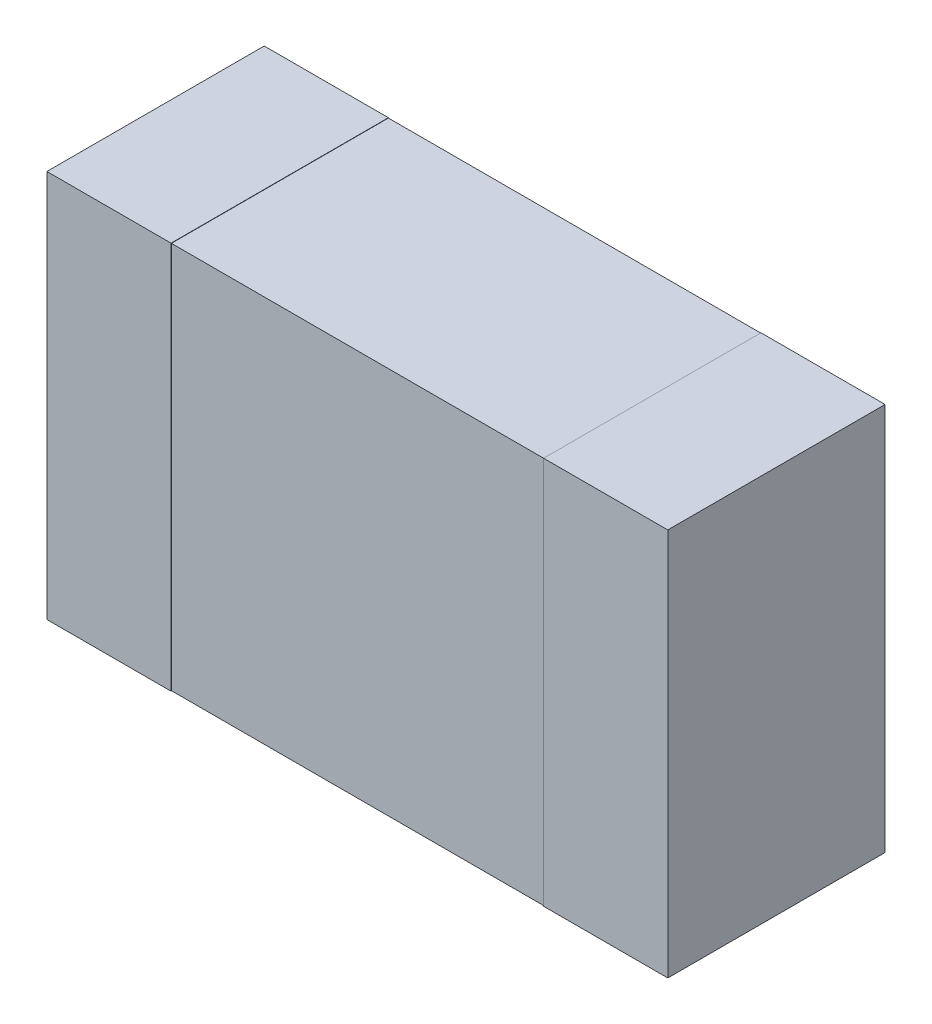
ISO-10303-21;
HEADER;
FILE_DESCRIPTION(('STEP AP214'),'2;1');
FILE_NAME('part.step','',(''),(''),'','','');
FILE_SCHEMA(('AUTOMOTIVE_DESIGN { 1 0 10303 214 1 1 1 1 }'));
ENDSEC;
DATA;
#1=APPLICATION_CONTEXT('core data for automotive mechanical design processes');
#2=APPLICATION_PROTOCOL_DEFINITION('international standard','automotive_design',2000,#1);
#3=PRODUCT_CONTEXT('',#1,'mechanical');
#4=PRODUCT('Part','Part','',(#3));
#5=PRODUCT_RELATED_PRODUCT_CATEGORY('part','',(#4));
#6=PRODUCT_DEFINITION_FORMATION('','',#4);
#7=PRODUCT_DEFINITION_CONTEXT('part definition',#1,'design');
#8=PRODUCT_DEFINITION('design','',#6,#7);
#9=PRODUCT_DEFINITION_SHAPE('','',#8);
#10=(LENGTH_UNIT() NAMED_UNIT(*) SI_UNIT(.MILLI.,.METRE.));
#11=(NAMED_UNIT(*) PLANE_ANGLE_UNIT() SI_UNIT($,.RADIAN.));
#12=(NAMED_UNIT(*) SI_UNIT($,.STERADIAN.) SOLID_ANGLE_UNIT());
#13=UNCERTAINTY_MEASURE_WITH_UNIT(LENGTH_MEASURE(1.E-05),#10,'distance_accuracy_value','');
#14=(GEOMETRIC_REPRESENTATION_CONTEXT(3) GLOBAL_UNCERTAINTY_ASSIGNED_CONTEXT((#13)) GLOBAL_UNIT_ASSIGNED_CONTEXT((#10,
#11,#12)) REPRESENTATION_CONTEXT('',''));
#15=CARTESIAN_POINT('',(0.,0.,0.));
#16=DIRECTION('',(0.,0.,1.));
#17=DIRECTION('',(1.,0.,0.));
#18=AXIS2_PLACEMENT_3D('',#15,#16,#17);
#19=CARTESIAN_POINT('',(0.6,-0.625,0.699));
#20=DIRECTION('',(0.,0.,-1.));
#21=DIRECTION('',(-1.,0.,0.));
#22=AXIS2_PLACEMENT_3D('',#19,#20,#21);
#23=PLANE('',#22);
#24=DIRECTION('',(0.,1.,0.));
#25=VECTOR('',#24,1.);
#26=CARTESIAN_POINT('',(0.6,-0.625,0.699));
#27=LINE('',#26,#25);
#28=CARTESIAN_POINT('',(0.6,-0.624,0.699));
#29=VERTEX_POINT('',#28);
#30=CARTESIAN_POINT('',(0.6,0.624,0.699));
#31=VERTEX_POINT('',#30);
#32=EDGE_CURVE('E45',#29,#31,#27,.T.);
#33=ORIENTED_EDGE('',*,*,#32,.T.);
#34=DIRECTION('',(-1.,0.,0.));
#35=VECTOR('',#34,1.);
#36=CARTESIAN_POINT('',(0.6,0.624,0.699));
#37=LINE('',#36,#35);
#38=CARTESIAN_POINT('',(-0.6,0.624,0.699));
#39=VERTEX_POINT('',#38);
#40=EDGE_CURVE('E184',#31,#39,#37,.T.);
#41=ORIENTED_EDGE('',*,*,#40,.T.);
#42=DIRECTION('',(0.,1.,0.));
#43=VECTOR('',#42,1.);
#44=CARTESIAN_POINT('',(-0.6,-0.625,0.699));
#45=LINE('',#44,#43);
#46=CARTESIAN_POINT('',(-0.6,-0.624,0.699));
#47=VERTEX_POINT('',#46);
#48=EDGE_CURVE('E22',#47,#39,#45,.T.);
#49=ORIENTED_EDGE('',*,*,#48,.F.);
#50=DIRECTION('',(-1.,0.,0.));
#51=VECTOR('',#50,1.);
#52=CARTESIAN_POINT('',(0.6,-0.624,0.699));
#53=LINE('',#52,#51);
#54=EDGE_CURVE('E11',#29,#47,#53,.T.);
#55=ORIENTED_EDGE('',*,*,#54,.F.);
#56=EDGE_LOOP('',(#33,#41,#49,#55));
#57=FACE_BOUND('',#56,.T.);
#58=ADVANCED_FACE('F18',(#57),#23,.F.);
#59=CARTESIAN_POINT('',(0.6,-0.624,0.7));
#60=DIRECTION('',(0.,1.,0.));
#61=DIRECTION('',(1.,0.,0.));
#62=AXIS2_PLACEMENT_3D('',#59,#60,#61);
#63=PLANE('',#62);
#64=DIRECTION('',(0.,0.,-1.));
#65=VECTOR('',#64,1.);
#66=CARTESIAN_POINT('',(0.6,-0.624,0.7));
#67=LINE('',#66,#65);
#68=CARTESIAN_POINT('',(0.6,-0.624,0.));
#69=VERTEX_POINT('',#68);
#70=EDGE_CURVE('E28',#29,#69,#67,.T.);
#71=ORIENTED_EDGE('',*,*,#70,.F.);
#72=ORIENTED_EDGE('',*,*,#54,.T.);
#73=DIRECTION('',(0.,0.,-1.));
#74=VECTOR('',#73,1.);
#75=CARTESIAN_POINT('',(-0.6,-0.624,0.7));
#76=LINE('',#75,#74);
#77=CARTESIAN_POINT('',(-0.6,-0.624,0.));
#78=VERTEX_POINT('',#77);
#79=EDGE_CURVE('E230',#47,#78,#76,.T.);
#80=ORIENTED_EDGE('',*,*,#79,.T.);
#81=DIRECTION('',(1.,0.,0.));
#82=VECTOR('',#81,1.);
#83=CARTESIAN_POINT('',(0.6,-0.624,0.));
#84=LINE('',#83,#82);
#85=EDGE_CURVE('E147',#78,#69,#84,.T.);
#86=ORIENTED_EDGE('',*,*,#85,.T.);
#87=EDGE_LOOP('',(#71,#72,#80,#86));
#88=FACE_BOUND('',#87,.T.);
#89=ADVANCED_FACE('F270',(#88),#63,.F.);
#90=CARTESIAN_POINT('',(0.6,0.625,0.7));
#91=DIRECTION('',(1.,0.,0.));
#92=DIRECTION('',(0.,1.,0.));
#93=AXIS2_PLACEMENT_3D('',#90,#91,#92);
#94=PLANE('',#93);
#95=DIRECTION('',(0.,-1.,0.));
#96=VECTOR('',#95,1.);
#97=CARTESIAN_POINT('',(0.6,0.625,0.));
#98=LINE('',#97,#96);
#99=CARTESIAN_POINT('',(0.6,0.625,0.));
#100=VERTEX_POINT('',#99);
#101=CARTESIAN_POINT('',(0.6,0.624,0.));
#102=VERTEX_POINT('',#101);
#103=EDGE_CURVE('E219',#100,#102,#98,.T.);
#104=ORIENTED_EDGE('',*,*,#103,.T.);
#105=DIRECTION('',(0.,0.,-1.));
#106=VECTOR('',#105,1.);
#107=CARTESIAN_POINT('',(0.6,0.624,0.7));
#108=LINE('',#107,#106);
#109=EDGE_CURVE('E195',#31,#102,#108,.T.);
#110=ORIENTED_EDGE('',*,*,#109,.F.);
#111=ORIENTED_EDGE('',*,*,#32,.F.);
#112=ORIENTED_EDGE('',*,*,#70,.T.);
#113=DIRECTION('',(0.,-1.,0.));
#114=VECTOR('',#113,1.);
#115=CARTESIAN_POINT('',(0.6,-0.624,0.));
#116=LINE('',#115,#114);
#117=CARTESIAN_POINT('',(0.6,-0.625,0.));
#118=VERTEX_POINT('',#117);
#119=EDGE_CURVE('E233',#69,#118,#116,.T.);
#120=ORIENTED_EDGE('',*,*,#119,.T.);
#121=DIRECTION('',(0.,0.,-1.));
#122=VECTOR('',#121,1.);
#123=CARTESIAN_POINT('',(0.6,-0.625,0.7));
#124=LINE('',#123,#122);
#125=CARTESIAN_POINT('',(0.6,-0.625,0.7));
#126=VERTEX_POINT('',#125);
#127=EDGE_CURVE('E143',#126,#118,#124,.T.);
#128=ORIENTED_EDGE('',*,*,#127,.F.);
#129=DIRECTION('',(0.,-1.,0.));
#130=VECTOR('',#129,1.);
#131=CARTESIAN_POINT('',(0.6,0.625,0.7));
#132=LINE('',#131,#130);
#133=CARTESIAN_POINT('',(0.6,0.625,0.7));
#134=VERTEX_POINT('',#133);
#135=EDGE_CURVE('E136',#134,#126,#132,.T.);
#136=ORIENTED_EDGE('',*,*,#135,.F.);
#137=DIRECTION('',(0.,0.,-1.));
#138=VECTOR('',#137,1.);
#139=CARTESIAN_POINT('',(0.6,0.625,0.7));
#140=LINE('',#139,#138);
#141=EDGE_CURVE('E140',#134,#100,#140,.T.);
#142=ORIENTED_EDGE('',*,*,#141,.T.);
#143=EDGE_LOOP('',(#104,#110,#111,#112,#120,#128,#136,#142));
#144=FACE_BOUND('',#143,.T.);
#145=ADVANCED_FACE('F20',(#144),#94,.F.);
#146=CARTESIAN_POINT('',(0.6,0.624,0.7));
#147=DIRECTION('',(0.,-1.,0.));
#148=DIRECTION('',(0.,0.,-1.));
#149=AXIS2_PLACEMENT_3D('',#146,#147,#148);
#150=PLANE('',#149);
#151=DIRECTION('',(0.,0.,-1.));
#152=VECTOR('',#151,1.);
#153=CARTESIAN_POINT('',(-0.6,0.624,0.7));
#154=LINE('',#153,#152);
#155=CARTESIAN_POINT('',(-0.6,0.624,0.));
#156=VERTEX_POINT('',#155);
#157=EDGE_CURVE('E181',#39,#156,#154,.T.);
#158=ORIENTED_EDGE('',*,*,#157,.F.);
#159=ORIENTED_EDGE('',*,*,#40,.F.);
#160=ORIENTED_EDGE('',*,*,#109,.T.);
#161=DIRECTION('',(-1.,0.,0.));
#162=VECTOR('',#161,1.);
#163=CARTESIAN_POINT('',(0.6,0.624,0.));
#164=LINE('',#163,#162);
#165=EDGE_CURVE('E215',#102,#156,#164,.T.);
#166=ORIENTED_EDGE('',*,*,#165,.T.);
#167=EDGE_LOOP('',(#158,#159,#160,#166));
#168=FACE_BOUND('',#167,.T.);
#169=ADVANCED_FACE('F292',(#168),#150,.F.);
#170=CARTESIAN_POINT('',(-0.6,0.625,0.7));
#171=DIRECTION('',(-1.,0.,0.));
#172=DIRECTION('',(0.,0.,1.));
#173=AXIS2_PLACEMENT_3D('',#170,#171,#172);
#174=PLANE('',#173);
#175=DIRECTION('',(0.,1.,0.));
#176=VECTOR('',#175,1.);
#177=CARTESIAN_POINT('',(-0.6,0.625,0.));
#178=LINE('',#177,#176);
#179=CARTESIAN_POINT('',(-0.6,0.625,0.));
#180=VERTEX_POINT('',#179);
#181=EDGE_CURVE('E220',#156,#180,#178,.T.);
#182=ORIENTED_EDGE('',*,*,#181,.T.);
#183=DIRECTION('',(0.,0.,-1.));
#184=VECTOR('',#183,1.);
#185=CARTESIAN_POINT('',(-0.6,0.625,0.7));
#186=LINE('',#185,#184);
#187=CARTESIAN_POINT('',(-0.6,0.625,0.7));
#188=VERTEX_POINT('',#187);
#189=EDGE_CURVE('E209',#188,#180,#186,.T.);
#190=ORIENTED_EDGE('',*,*,#189,.F.);
#191=DIRECTION('',(0.,1.,0.));
#192=VECTOR('',#191,1.);
#193=CARTESIAN_POINT('',(-0.6,0.625,0.7));
#194=LINE('',#193,#192);
#195=CARTESIAN_POINT('',(-0.6,-0.625,0.7));
#196=VERTEX_POINT('',#195);
#197=EDGE_CURVE('E187',#196,#188,#194,.T.);
#198=ORIENTED_EDGE('',*,*,#197,.F.);
#199=DIRECTION('',(0.,0.,-1.));
#200=VECTOR('',#199,1.);
#201=CARTESIAN_POINT('',(-0.6,-0.625,0.7));
#202=LINE('',#201,#200);
#203=CARTESIAN_POINT('',(-0.6,-0.625,0.));
#204=VERTEX_POINT('',#203);
#205=EDGE_CURVE('E226',#196,#204,#202,.T.);
#206=ORIENTED_EDGE('',*,*,#205,.T.);
#207=DIRECTION('',(0.,1.,0.));
#208=VECTOR('',#207,1.);
#209=CARTESIAN_POINT('',(-0.6,-0.624,0.));
#210=LINE('',#209,#208);
#211=EDGE_CURVE('E236',#204,#78,#210,.T.);
#212=ORIENTED_EDGE('',*,*,#211,.T.);
#213=ORIENTED_EDGE('',*,*,#79,.F.);
#214=ORIENTED_EDGE('',*,*,#48,.T.);
#215=ORIENTED_EDGE('',*,*,#157,.T.);
#216=EDGE_LOOP('',(#182,#190,#198,#206,#212,#213,#214,#215));
#217=FACE_BOUND('',#216,.T.);
#218=ADVANCED_FACE('F307',(#217),#174,.F.);
#219=CARTESIAN_POINT('',(0.,0.,0.));
#220=DIRECTION('',(0.,0.,1.));
#221=DIRECTION('',(1.,0.,0.));
#222=AXIS2_PLACEMENT_3D('',#219,#220,#221);
#223=PLANE('',#222);
#224=ORIENTED_EDGE('',*,*,#85,.F.);
#225=ORIENTED_EDGE('',*,*,#211,.F.);
#226=DIRECTION('',(1.,0.,0.));
#227=VECTOR('',#226,1.);
#228=CARTESIAN_POINT('',(-1.,-0.625,0.));
#229=LINE('',#228,#227);
#230=CARTESIAN_POINT('',(-1.,-0.625,0.));
#231=VERTEX_POINT('',#230);
#232=EDGE_CURVE('E214',#231,#204,#229,.T.);
#233=ORIENTED_EDGE('',*,*,#232,.F.);
#234=DIRECTION('',(0.,-1.,0.));
#235=VECTOR('',#234,1.);
#236=CARTESIAN_POINT('',(-1.,0.625,0.));
#237=LINE('',#236,#235);
#238=CARTESIAN_POINT('',(-1.,0.625,0.));
#239=VERTEX_POINT('',#238);
#240=EDGE_CURVE('E159',#239,#231,#237,.T.);
#241=ORIENTED_EDGE('',*,*,#240,.F.);
#242=DIRECTION('',(-1.,0.,0.));
#243=VECTOR('',#242,1.);
#244=CARTESIAN_POINT('',(-1.,0.625,0.));
#245=LINE('',#244,#243);
#246=EDGE_CURVE('E202',#180,#239,#245,.T.);
#247=ORIENTED_EDGE('',*,*,#246,.F.);
#248=ORIENTED_EDGE('',*,*,#181,.F.);
#249=ORIENTED_EDGE('',*,*,#165,.F.);
#250=ORIENTED_EDGE('',*,*,#103,.F.);
#251=DIRECTION('',(-1.,0.,0.));
#252=VECTOR('',#251,1.);
#253=CARTESIAN_POINT('',(-1.,0.625,0.));
#254=LINE('',#253,#252);
#255=CARTESIAN_POINT('',(1.,0.625,0.));
#256=VERTEX_POINT('',#255);
#257=EDGE_CURVE('E162',#256,#100,#254,.T.);
#258=ORIENTED_EDGE('',*,*,#257,.F.);
#259=DIRECTION('',(0.,1.,0.));
#260=VECTOR('',#259,1.);
#261=CARTESIAN_POINT('',(1.,0.625,0.));
#262=LINE('',#261,#260);
#263=CARTESIAN_POINT('',(1.,-0.625,0.));
#264=VERTEX_POINT('',#263);
#265=EDGE_CURVE('E197',#264,#256,#262,.T.);
#266=ORIENTED_EDGE('',*,*,#265,.F.);
#267=DIRECTION('',(1.,0.,0.));
#268=VECTOR('',#267,1.);
#269=CARTESIAN_POINT('',(-1.,-0.625,0.));
#270=LINE('',#269,#268);
#271=EDGE_CURVE('E148',#118,#264,#270,.T.);
#272=ORIENTED_EDGE('',*,*,#271,.F.);
#273=ORIENTED_EDGE('',*,*,#119,.F.);
#274=EDGE_LOOP('',(#224,#225,#233,#241,#247,#248,#249,#250,#258,#266,#272,#273));
#275=FACE_BOUND('',#274,.T.);
#276=ADVANCED_FACE('F274',(#275),#223,.F.);
#277=CARTESIAN_POINT('',(0.,0.,0.7));
#278=DIRECTION('',(0.,0.,1.));
#279=DIRECTION('',(1.,0.,0.));
#280=AXIS2_PLACEMENT_3D('',#277,#278,#279);
#281=PLANE('',#280);
#282=ORIENTED_EDGE('',*,*,#135,.T.);
#283=DIRECTION('',(1.,0.,0.));
#284=VECTOR('',#283,1.);
#285=CARTESIAN_POINT('',(-1.,-0.625,0.7));
#286=LINE('',#285,#284);
#287=CARTESIAN_POINT('',(1.,-0.625,0.7));
#288=VERTEX_POINT('',#287);
#289=EDGE_CURVE('E175',#126,#288,#286,.T.);
#290=ORIENTED_EDGE('',*,*,#289,.T.);
#291=DIRECTION('',(0.,1.,0.));
#292=VECTOR('',#291,1.);
#293=CARTESIAN_POINT('',(1.,0.625,0.7));
#294=LINE('',#293,#292);
#295=CARTESIAN_POINT('',(1.,0.625,0.7));
#296=VERTEX_POINT('',#295);
#297=EDGE_CURVE('E154',#288,#296,#294,.T.);
#298=ORIENTED_EDGE('',*,*,#297,.T.);
#299=DIRECTION('',(-1.,0.,0.));
#300=VECTOR('',#299,1.);
#301=CARTESIAN_POINT('',(-1.,0.625,0.7));
#302=LINE('',#301,#300);
#303=EDGE_CURVE('E151',#296,#134,#302,.T.);
#304=ORIENTED_EDGE('',*,*,#303,.T.);
#305=EDGE_LOOP('',(#282,#290,#298,#304));
#306=FACE_BOUND('',#305,.T.);
#307=ADVANCED_FACE('F152',(#306),#281,.T.);
#308=CARTESIAN_POINT('',(-1.,-0.625,0.7));
#309=DIRECTION('',(0.,1.,0.));
#310=DIRECTION('',(1.,0.,0.));
#311=AXIS2_PLACEMENT_3D('',#308,#309,#310);
#312=PLANE('',#311);
#313=ORIENTED_EDGE('',*,*,#289,.F.);
#314=ORIENTED_EDGE('',*,*,#127,.T.);
#315=ORIENTED_EDGE('',*,*,#271,.T.);
#316=DIRECTION('',(0.,0.,-1.));
#317=VECTOR('',#316,1.);
#318=CARTESIAN_POINT('',(1.,-0.625,0.7));
#319=LINE('',#318,#317);
#320=EDGE_CURVE('E169',#288,#264,#319,.T.);
#321=ORIENTED_EDGE('',*,*,#320,.F.);
#322=EDGE_LOOP('',(#313,#314,#315,#321));
#323=FACE_BOUND('',#322,.T.);
#324=ADVANCED_FACE('F377',(#323),#312,.F.);
#325=CARTESIAN_POINT('',(-1.,0.625,0.7));
#326=DIRECTION('',(1.,0.,0.));
#327=DIRECTION('',(0.,1.,0.));
#328=AXIS2_PLACEMENT_3D('',#325,#326,#327);
#329=PLANE('',#328);
#330=ORIENTED_EDGE('',*,*,#240,.T.);
#331=DIRECTION('',(0.,0.,-1.));
#332=VECTOR('',#331,1.);
#333=CARTESIAN_POINT('',(-1.,-0.625,0.7));
#334=LINE('',#333,#332);
#335=CARTESIAN_POINT('',(-1.,-0.625,0.7));
#336=VERTEX_POINT('',#335);
#337=EDGE_CURVE('E173',#336,#231,#334,.T.);
#338=ORIENTED_EDGE('',*,*,#337,.F.);
#339=DIRECTION('',(0.,-1.,0.));
#340=VECTOR('',#339,1.);
#341=CARTESIAN_POINT('',(-1.,0.625,0.7));
#342=LINE('',#341,#340);
#343=CARTESIAN_POINT('',(-1.,0.625,0.7));
#344=VERTEX_POINT('',#343);
#345=EDGE_CURVE('E210',#344,#336,#342,.T.);
#346=ORIENTED_EDGE('',*,*,#345,.F.);
#347=DIRECTION('',(0.,0.,-1.));
#348=VECTOR('',#347,1.);
#349=CARTESIAN_POINT('',(-1.,0.625,0.7));
#350=LINE('',#349,#348);
#351=EDGE_CURVE('E199',#344,#239,#350,.T.);
#352=ORIENTED_EDGE('',*,*,#351,.T.);
#353=EDGE_LOOP('',(#330,#338,#346,#352));
#354=FACE_BOUND('',#353,.T.);
#355=ADVANCED_FACE('F383',(#354),#329,.F.);
#356=CARTESIAN_POINT('',(-1.,0.625,0.7));
#357=DIRECTION('',(0.,-1.,0.));
#358=DIRECTION('',(0.,0.,-1.));
#359=AXIS2_PLACEMENT_3D('',#356,#357,#358);
#360=PLANE('',#359);
#361=ORIENTED_EDGE('',*,*,#257,.T.);
#362=ORIENTED_EDGE('',*,*,#141,.F.);
#363=ORIENTED_EDGE('',*,*,#303,.F.);
#364=DIRECTION('',(0.,0.,-1.));
#365=VECTOR('',#364,1.);
#366=CARTESIAN_POINT('',(1.,0.625,0.7));
#367=LINE('',#366,#365);
#368=EDGE_CURVE('E180',#296,#256,#367,.T.);
#369=ORIENTED_EDGE('',*,*,#368,.T.);
#370=EDGE_LOOP('',(#361,#362,#363,#369));
#371=FACE_BOUND('',#370,.T.);
#372=ADVANCED_FACE('F161',(#371),#360,.F.);
#373=CARTESIAN_POINT('',(1.,0.625,0.7));
#374=DIRECTION('',(-1.,0.,0.));
#375=DIRECTION('',(0.,0.,1.));
#376=AXIS2_PLACEMENT_3D('',#373,#374,#375);
#377=PLANE('',#376);
#378=ORIENTED_EDGE('',*,*,#265,.T.);
#379=ORIENTED_EDGE('',*,*,#368,.F.);
#380=ORIENTED_EDGE('',*,*,#297,.F.);
#381=ORIENTED_EDGE('',*,*,#320,.T.);
#382=EDGE_LOOP('',(#378,#379,#380,#381));
#383=FACE_BOUND('',#382,.T.);
#384=ADVANCED_FACE('F409',(#383),#377,.F.);
#385=CARTESIAN_POINT('',(-1.,0.625,0.7));
#386=DIRECTION('',(0.,-1.,0.));
#387=DIRECTION('',(0.,0.,-1.));
#388=AXIS2_PLACEMENT_3D('',#385,#386,#387);
#389=PLANE('',#388);
#390=DIRECTION('',(-1.,0.,0.));
#391=VECTOR('',#390,1.);
#392=CARTESIAN_POINT('',(-1.,0.625,0.7));
#393=LINE('',#392,#391);
#394=EDGE_CURVE('E191',#188,#344,#393,.T.);
#395=ORIENTED_EDGE('',*,*,#394,.F.);
#396=ORIENTED_EDGE('',*,*,#189,.T.);
#397=ORIENTED_EDGE('',*,*,#246,.T.);
#398=ORIENTED_EDGE('',*,*,#351,.F.);
#399=EDGE_LOOP('',(#395,#396,#397,#398));
#400=FACE_BOUND('',#399,.T.);
#401=ADVANCED_FACE('F310',(#400),#389,.F.);
#402=CARTESIAN_POINT('',(-1.,-0.625,0.7));
#403=DIRECTION('',(0.,1.,0.));
#404=DIRECTION('',(1.,0.,0.));
#405=AXIS2_PLACEMENT_3D('',#402,#403,#404);
#406=PLANE('',#405);
#407=ORIENTED_EDGE('',*,*,#232,.T.);
#408=ORIENTED_EDGE('',*,*,#205,.F.);
#409=DIRECTION('',(1.,0.,0.));
#410=VECTOR('',#409,1.);
#411=CARTESIAN_POINT('',(-1.,-0.625,0.7));
#412=LINE('',#411,#410);
#413=EDGE_CURVE('E192',#336,#196,#412,.T.);
#414=ORIENTED_EDGE('',*,*,#413,.F.);
#415=ORIENTED_EDGE('',*,*,#337,.T.);
#416=EDGE_LOOP('',(#407,#408,#414,#415));
#417=FACE_BOUND('',#416,.T.);
#418=ADVANCED_FACE('F306',(#417),#406,.F.);
#419=CARTESIAN_POINT('',(0.,0.,0.7));
#420=DIRECTION('',(0.,0.,1.));
#421=DIRECTION('',(1.,0.,0.));
#422=AXIS2_PLACEMENT_3D('',#419,#420,#421);
#423=PLANE('',#422);
#424=ORIENTED_EDGE('',*,*,#413,.T.);
#425=ORIENTED_EDGE('',*,*,#197,.T.);
#426=ORIENTED_EDGE('',*,*,#394,.T.);
#427=ORIENTED_EDGE('',*,*,#345,.T.);
#428=EDGE_LOOP('',(#424,#425,#426,#427));
#429=FACE_BOUND('',#428,.T.);
#430=ADVANCED_FACE('F303',(#429),#423,.T.);
#431=CLOSED_SHELL('',(#58,#89,#145,#169,#218,#276,#307,#324,#355,#372,#384,#401,#418,#430));
#432=MANIFOLD_SOLID_BREP('B1',#431);
#433=ADVANCED_BREP_SHAPE_REPRESENTATION('',(#18,#432),#14);
#434=SHAPE_DEFINITION_REPRESENTATION(#9,#433);
ENDSEC;
END-ISO-10303-21;
